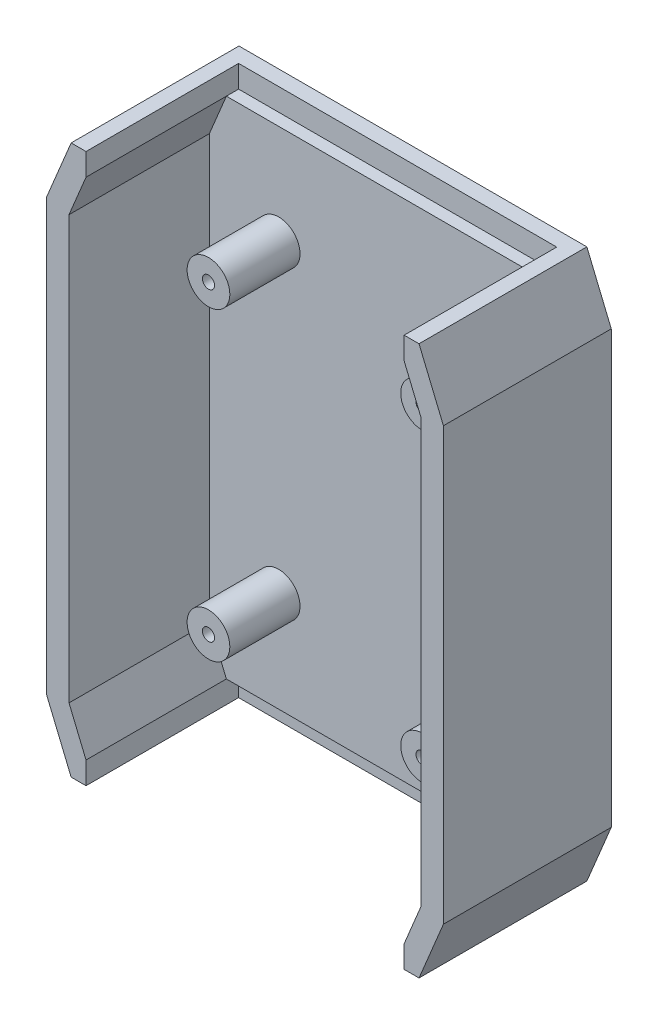
ISO-10303-21;
HEADER;
FILE_DESCRIPTION(('STEP AP214'),'2;1');
FILE_NAME('part.step','',(''),(''),'','','');
FILE_SCHEMA(('AUTOMOTIVE_DESIGN { 1 0 10303 214 1 1 1 1 }'));
ENDSEC;
DATA;
#1=APPLICATION_CONTEXT('core data for automotive mechanical design processes');
#2=APPLICATION_PROTOCOL_DEFINITION('international standard','automotive_design',2000,#1);
#3=PRODUCT_CONTEXT('',#1,'mechanical');
#4=PRODUCT('Part','Part','',(#3));
#5=PRODUCT_RELATED_PRODUCT_CATEGORY('part','',(#4));
#6=PRODUCT_DEFINITION_FORMATION('','',#4);
#7=PRODUCT_DEFINITION_CONTEXT('part definition',#1,'design');
#8=PRODUCT_DEFINITION('design','',#6,#7);
#9=PRODUCT_DEFINITION_SHAPE('','',#8);
#10=(LENGTH_UNIT() NAMED_UNIT(*) SI_UNIT(.MILLI.,.METRE.));
#11=(NAMED_UNIT(*) PLANE_ANGLE_UNIT() SI_UNIT($,.RADIAN.));
#12=(NAMED_UNIT(*) SI_UNIT($,.STERADIAN.) SOLID_ANGLE_UNIT());
#13=UNCERTAINTY_MEASURE_WITH_UNIT(LENGTH_MEASURE(1.E-05),#10,'distance_accuracy_value','');
#14=(GEOMETRIC_REPRESENTATION_CONTEXT(3) GLOBAL_UNCERTAINTY_ASSIGNED_CONTEXT((#13)) GLOBAL_UNIT_ASSIGNED_CONTEXT((#10,
#11,#12)) REPRESENTATION_CONTEXT('',''));
#15=CARTESIAN_POINT('',(0.,0.,0.));
#16=DIRECTION('',(0.,0.,1.));
#17=DIRECTION('',(1.,0.,0.));
#18=AXIS2_PLACEMENT_3D('',#15,#16,#17);
#19=CARTESIAN_POINT('',(0.,-57.15,5.715));
#20=DIRECTION('',(0.,1.,0.));
#21=DIRECTION('',(0.,0.,1.));
#22=AXIS2_PLACEMENT_3D('',#19,#20,#21);
#23=PLANE('',#22);
#24=DIRECTION('',(0.,0.,1.));
#25=VECTOR('',#24,1.);
#26=CARTESIAN_POINT('',(-33.1004294659972,-57.15,3.175));
#27=LINE('',#26,#25);
#28=CARTESIAN_POINT('',(-33.1004294659972,-57.15,3.175));
#29=VERTEX_POINT('',#28);
#30=CARTESIAN_POINT('',(-33.1004294659972,-57.15,34.925));
#31=VERTEX_POINT('',#30);
#32=EDGE_CURVE('E186',#29,#31,#27,.T.);
#33=ORIENTED_EDGE('',*,*,#32,.T.);
#34=DIRECTION('',(1.,0.,0.));
#35=VECTOR('',#34,1.);
#36=CARTESIAN_POINT('',(0.,-57.15,34.925));
#37=LINE('',#36,#35);
#38=CARTESIAN_POINT('',(-36.195,-57.15,34.925));
#39=VERTEX_POINT('',#38);
#40=EDGE_CURVE('E277',#39,#31,#37,.T.);
#41=ORIENTED_EDGE('',*,*,#40,.F.);
#42=DIRECTION('',(0.,0.,-1.));
#43=VECTOR('',#42,1.);
#44=CARTESIAN_POINT('',(-36.195,-57.15,5.715));
#45=LINE('',#44,#43);
#46=CARTESIAN_POINT('',(-36.195,-57.15,0.));
#47=VERTEX_POINT('',#46);
#48=EDGE_CURVE('E11',#39,#47,#45,.T.);
#49=ORIENTED_EDGE('',*,*,#48,.T.);
#50=DIRECTION('',(1.,0.,0.));
#51=VECTOR('',#50,1.);
#52=CARTESIAN_POINT('',(0.,-57.15,0.));
#53=LINE('',#52,#51);
#54=CARTESIAN_POINT('',(36.195,-57.15,0.));
#55=VERTEX_POINT('',#54);
#56=EDGE_CURVE('E336',#47,#55,#53,.T.);
#57=ORIENTED_EDGE('',*,*,#56,.T.);
#58=DIRECTION('',(0.,0.,-1.));
#59=VECTOR('',#58,1.);
#60=CARTESIAN_POINT('',(36.195,-57.15,5.715));
#61=LINE('',#60,#59);
#62=CARTESIAN_POINT('',(36.195,-57.1499999999999,34.925));
#63=VERTEX_POINT('',#62);
#64=EDGE_CURVE('E45',#63,#55,#61,.T.);
#65=ORIENTED_EDGE('',*,*,#64,.F.);
#66=CARTESIAN_POINT('',(33.1004294659972,-57.15,34.925));
#67=VERTEX_POINT('',#66);
#68=EDGE_CURVE('E276',#67,#63,#37,.T.);
#69=ORIENTED_EDGE('',*,*,#68,.F.);
#70=DIRECTION('',(0.,0.,1.));
#71=VECTOR('',#70,1.);
#72=CARTESIAN_POINT('',(33.1004294659972,-57.15,3.175));
#73=LINE('',#72,#71);
#74=CARTESIAN_POINT('',(33.1004294659972,-57.15,3.175));
#75=VERTEX_POINT('',#74);
#76=EDGE_CURVE('E198',#75,#67,#73,.T.);
#77=ORIENTED_EDGE('',*,*,#76,.F.);
#78=DIRECTION('',(-1.,0.,0.));
#79=VECTOR('',#78,1.);
#80=CARTESIAN_POINT('',(-33.1004294659972,-57.15,3.175));
#81=LINE('',#80,#79);
#82=EDGE_CURVE('E205',#75,#29,#81,.T.);
#83=ORIENTED_EDGE('',*,*,#82,.T.);
#84=EDGE_LOOP('',(#33,#41,#49,#57,#65,#69,#77,#83));
#85=FACE_BOUND('',#84,.T.);
#86=ADVANCED_FACE('F37',(#85),#23,.F.);
#87=CARTESIAN_POINT('',(0.,0.,34.925));
#88=DIRECTION('',(0.,0.,1.));
#89=DIRECTION('',(1.,0.,0.));
#90=AXIS2_PLACEMENT_3D('',#87,#88,#89);
#91=PLANE('',#90);
#92=ORIENTED_EDGE('',*,*,#40,.T.);
#93=DIRECTION('',(0.,1.,0.));
#94=VECTOR('',#93,1.);
#95=CARTESIAN_POINT('',(-33.1004294659972,-52.5145,34.925));
#96=LINE('',#95,#94);
#97=CARTESIAN_POINT('',(-33.1004294659972,-52.5145,34.925));
#98=VERTEX_POINT('',#97);
#99=EDGE_CURVE('E193',#31,#98,#96,.T.);
#100=ORIENTED_EDGE('',*,*,#99,.T.);
#101=DIRECTION('',(0.383447283100766,-0.923562765101886,0.));
#102=VECTOR('',#101,1.);
#103=CARTESIAN_POINT('',(-46.830973845541,-19.4434101986071,34.925));
#104=LINE('',#103,#102);
#105=CARTESIAN_POINT('',(-36.6395,-43.9903718803719,34.925));
#106=VERTEX_POINT('',#105);
#107=EDGE_CURVE('E264',#106,#98,#104,.T.);
#108=ORIENTED_EDGE('',*,*,#107,.F.);
#109=DIRECTION('',(0.,-1.,0.));
#110=VECTOR('',#109,1.);
#111=CARTESIAN_POINT('',(-36.6395,0.,34.925));
#112=LINE('',#111,#110);
#113=CARTESIAN_POINT('',(-36.6395,43.9903718803719,34.925));
#114=VERTEX_POINT('',#113);
#115=EDGE_CURVE('E267',#114,#106,#112,.T.);
#116=ORIENTED_EDGE('',*,*,#115,.F.);
#117=DIRECTION('',(-0.383447283100766,-0.923562765101886,0.));
#118=VECTOR('',#117,1.);
#119=CARTESIAN_POINT('',(-46.830973845541,19.443410198607,34.925));
#120=LINE('',#119,#118);
#121=CARTESIAN_POINT('',(-33.1004294659972,52.5145,34.925));
#122=VERTEX_POINT('',#121);
#123=EDGE_CURVE('E251',#122,#114,#120,.T.);
#124=ORIENTED_EDGE('',*,*,#123,.F.);
#125=DIRECTION('',(0.,-1.,0.));
#126=VECTOR('',#125,1.);
#127=CARTESIAN_POINT('',(-33.1004294659972,52.5145,34.925));
#128=LINE('',#127,#126);
#129=CARTESIAN_POINT('',(-33.1004294659972,57.15,34.925));
#130=VERTEX_POINT('',#129);
#131=EDGE_CURVE('E222',#130,#122,#128,.T.);
#132=ORIENTED_EDGE('',*,*,#131,.F.);
#133=DIRECTION('',(-1.,0.,0.));
#134=VECTOR('',#133,1.);
#135=CARTESIAN_POINT('',(0.,57.15,34.925));
#136=LINE('',#135,#134);
#137=CARTESIAN_POINT('',(-36.195,57.15,34.925));
#138=VERTEX_POINT('',#137);
#139=EDGE_CURVE('E288',#130,#138,#136,.T.);
#140=ORIENTED_EDGE('',*,*,#139,.T.);
#141=DIRECTION('',(-0.383447283100767,-0.923562765101886,0.));
#142=VECTOR('',#141,1.);
#143=CARTESIAN_POINT('',(-51.1121490431708,21.2208800794207,34.925));
#144=LINE('',#143,#142);
#145=CARTESIAN_POINT('',(-41.275,44.9144227681626,34.925));
#146=VERTEX_POINT('',#145);
#147=EDGE_CURVE('E292',#138,#146,#144,.T.);
#148=ORIENTED_EDGE('',*,*,#147,.T.);
#149=DIRECTION('',(0.,-1.,0.));
#150=VECTOR('',#149,1.);
#151=CARTESIAN_POINT('',(-41.275,0.,34.925));
#152=LINE('',#151,#150);
#153=CARTESIAN_POINT('',(-41.275,-44.9144227681627,34.925));
#154=VERTEX_POINT('',#153);
#155=EDGE_CURVE('E270',#146,#154,#152,.T.);
#156=ORIENTED_EDGE('',*,*,#155,.T.);
#157=DIRECTION('',(0.383447283100767,-0.923562765101886,0.));
#158=VECTOR('',#157,1.);
#159=CARTESIAN_POINT('',(-51.1121490431708,-21.2208800794207,34.925));
#160=LINE('',#159,#158);
#161=EDGE_CURVE('E273',#154,#39,#160,.T.);
#162=ORIENTED_EDGE('',*,*,#161,.T.);
#163=EDGE_LOOP('',(#92,#100,#108,#116,#124,#132,#140,#148,#156,#162));
#164=FACE_BOUND('',#163,.T.);
#165=ADVANCED_FACE('F401',(#164),#91,.T.);
#166=DIRECTION('',(0.383447283100766,0.923562765101886,0.));
#167=VECTOR('',#166,1.);
#168=CARTESIAN_POINT('',(46.830973845541,-19.443410198607,34.925));
#169=LINE('',#168,#167);
#170=CARTESIAN_POINT('',(33.1004294659972,-52.5145,34.925));
#171=VERTEX_POINT('',#170);
#172=CARTESIAN_POINT('',(36.6395,-43.9903718803721,34.925));
#173=VERTEX_POINT('',#172);
#174=EDGE_CURVE('E261',#171,#173,#169,.T.);
#175=ORIENTED_EDGE('',*,*,#174,.F.);
#176=DIRECTION('',(0.,-1.,0.));
#177=VECTOR('',#176,1.);
#178=CARTESIAN_POINT('',(33.1004294659972,-52.5145,34.925));
#179=LINE('',#178,#177);
#180=EDGE_CURVE('E207',#171,#67,#179,.T.);
#181=ORIENTED_EDGE('',*,*,#180,.T.);
#182=ORIENTED_EDGE('',*,*,#68,.T.);
#183=DIRECTION('',(0.383447283100766,0.923562765101886,0.));
#184=VECTOR('',#183,1.);
#185=CARTESIAN_POINT('',(51.1121490431708,-21.2208800794207,34.925));
#186=LINE('',#185,#184);
#187=CARTESIAN_POINT('',(41.275,-44.9144227681628,34.925));
#188=VERTEX_POINT('',#187);
#189=EDGE_CURVE('E279',#63,#188,#186,.T.);
#190=ORIENTED_EDGE('',*,*,#189,.T.);
#191=DIRECTION('',(0.,1.,0.));
#192=VECTOR('',#191,1.);
#193=CARTESIAN_POINT('',(41.275,0.,34.925));
#194=LINE('',#193,#192);
#195=CARTESIAN_POINT('',(41.275,44.9144227681628,34.925));
#196=VERTEX_POINT('',#195);
#197=EDGE_CURVE('E282',#188,#196,#194,.T.);
#198=ORIENTED_EDGE('',*,*,#197,.T.);
#199=DIRECTION('',(-0.383447283100766,0.923562765101886,0.));
#200=VECTOR('',#199,1.);
#201=CARTESIAN_POINT('',(51.1121490431708,21.2208800794207,34.925));
#202=LINE('',#201,#200);
#203=CARTESIAN_POINT('',(36.195,57.15,34.925));
#204=VERTEX_POINT('',#203);
#205=EDGE_CURVE('E285',#196,#204,#202,.T.);
#206=ORIENTED_EDGE('',*,*,#205,.T.);
#207=CARTESIAN_POINT('',(33.1004294659972,57.15,34.925));
#208=VERTEX_POINT('',#207);
#209=EDGE_CURVE('E289',#204,#208,#136,.T.);
#210=ORIENTED_EDGE('',*,*,#209,.T.);
#211=DIRECTION('',(0.,1.,0.));
#212=VECTOR('',#211,1.);
#213=CARTESIAN_POINT('',(33.1004294659972,52.5145,34.925));
#214=LINE('',#213,#212);
#215=CARTESIAN_POINT('',(33.1004294659972,52.5145,34.925));
#216=VERTEX_POINT('',#215);
#217=EDGE_CURVE('E230',#216,#208,#214,.T.);
#218=ORIENTED_EDGE('',*,*,#217,.F.);
#219=DIRECTION('',(-0.383447283100766,0.923562765101886,0.));
#220=VECTOR('',#219,1.);
#221=CARTESIAN_POINT('',(46.830973845541,19.443410198607,34.925));
#222=LINE('',#221,#220);
#223=CARTESIAN_POINT('',(36.6394999999999,43.9903718803721,34.925));
#224=VERTEX_POINT('',#223);
#225=EDGE_CURVE('E254',#224,#216,#222,.T.);
#226=ORIENTED_EDGE('',*,*,#225,.F.);
#227=DIRECTION('',(0.,1.,0.));
#228=VECTOR('',#227,1.);
#229=CARTESIAN_POINT('',(36.6395,0.,34.925));
#230=LINE('',#229,#228);
#231=EDGE_CURVE('E258',#173,#224,#230,.T.);
#232=ORIENTED_EDGE('',*,*,#231,.F.);
#233=EDGE_LOOP('',(#175,#181,#182,#190,#198,#206,#210,#218,#226,#232));
#234=FACE_BOUND('',#233,.T.);
#235=ADVANCED_FACE('F384',(#234),#91,.T.);
#236=CARTESIAN_POINT('',(-51.1121490431708,-21.2208800794207,5.715));
#237=DIRECTION('',(-0.923562765101886,-0.383447283100766,0.));
#238=DIRECTION('',(0.383447283100767,-0.923562765101886,0.));
#239=AXIS2_PLACEMENT_3D('',#236,#237,#238);
#240=PLANE('',#239);
#241=DIRECTION('',(-0.383447283100767,0.923562765101886,0.));
#242=VECTOR('',#241,1.);
#243=CARTESIAN_POINT('',(-51.1121490431708,-21.2208800794207,0.));
#244=LINE('',#243,#242);
#245=CARTESIAN_POINT('',(-41.275,-44.9144227681627,0.));
#246=VERTEX_POINT('',#245);
#247=EDGE_CURVE('E333',#47,#246,#244,.T.);
#248=ORIENTED_EDGE('',*,*,#247,.F.);
#249=ORIENTED_EDGE('',*,*,#48,.F.);
#250=ORIENTED_EDGE('',*,*,#161,.F.);
#251=DIRECTION('',(0.,0.,-1.));
#252=VECTOR('',#251,1.);
#253=CARTESIAN_POINT('',(-41.275,-44.9144227681627,5.715));
#254=LINE('',#253,#252);
#255=EDGE_CURVE('E355',#154,#246,#254,.T.);
#256=ORIENTED_EDGE('',*,*,#255,.T.);
#257=EDGE_LOOP('',(#248,#249,#250,#256));
#258=FACE_BOUND('',#257,.T.);
#259=ADVANCED_FACE('F39',(#258),#240,.T.);
#260=CARTESIAN_POINT('',(51.1121490431708,-21.2208800794207,5.715));
#261=DIRECTION('',(-0.923562765101886,0.383447283100766,0.));
#262=DIRECTION('',(-0.383447283100766,-0.923562765101886,0.));
#263=AXIS2_PLACEMENT_3D('',#260,#261,#262);
#264=PLANE('',#263);
#265=DIRECTION('',(0.383447283100766,0.923562765101886,0.));
#266=VECTOR('',#265,1.);
#267=CARTESIAN_POINT('',(51.1121490431708,-21.2208800794207,0.));
#268=LINE('',#267,#266);
#269=CARTESIAN_POINT('',(41.275,-44.9144227681628,0.));
#270=VERTEX_POINT('',#269);
#271=EDGE_CURVE('E338',#55,#270,#268,.T.);
#272=ORIENTED_EDGE('',*,*,#271,.T.);
#273=DIRECTION('',(0.,0.,-1.));
#274=VECTOR('',#273,1.);
#275=CARTESIAN_POINT('',(41.275,-44.9144227681628,5.715));
#276=LINE('',#275,#274);
#277=EDGE_CURVE('E366',#188,#270,#276,.T.);
#278=ORIENTED_EDGE('',*,*,#277,.F.);
#279=ORIENTED_EDGE('',*,*,#189,.F.);
#280=ORIENTED_EDGE('',*,*,#64,.T.);
#281=EDGE_LOOP('',(#272,#278,#279,#280));
#282=FACE_BOUND('',#281,.T.);
#283=ADVANCED_FACE('F372',(#282),#264,.F.);
#284=CARTESIAN_POINT('',(41.275,0.,5.715));
#285=DIRECTION('',(1.,0.,0.));
#286=DIRECTION('',(0.,1.,0.));
#287=AXIS2_PLACEMENT_3D('',#284,#285,#286);
#288=PLANE('',#287);
#289=DIRECTION('',(0.,-1.,0.));
#290=VECTOR('',#289,1.);
#291=CARTESIAN_POINT('',(41.275,0.,0.));
#292=LINE('',#291,#290);
#293=CARTESIAN_POINT('',(41.275,44.9144227681628,0.));
#294=VERTEX_POINT('',#293);
#295=EDGE_CURVE('E341',#294,#270,#292,.T.);
#296=ORIENTED_EDGE('',*,*,#295,.F.);
#297=DIRECTION('',(0.,0.,-1.));
#298=VECTOR('',#297,1.);
#299=CARTESIAN_POINT('',(41.275,44.9144227681628,5.715));
#300=LINE('',#299,#298);
#301=EDGE_CURVE('E364',#196,#294,#300,.T.);
#302=ORIENTED_EDGE('',*,*,#301,.F.);
#303=ORIENTED_EDGE('',*,*,#197,.F.);
#304=ORIENTED_EDGE('',*,*,#277,.T.);
#305=EDGE_LOOP('',(#296,#302,#303,#304));
#306=FACE_BOUND('',#305,.T.);
#307=ADVANCED_FACE('F380',(#306),#288,.T.);
#308=CARTESIAN_POINT('',(51.1121490431708,21.2208800794207,5.715));
#309=DIRECTION('',(0.923562765101886,0.383447283100766,0.));
#310=DIRECTION('',(-0.383447283100766,0.923562765101886,0.));
#311=AXIS2_PLACEMENT_3D('',#308,#309,#310);
#312=PLANE('',#311);
#313=DIRECTION('',(0.383447283100766,-0.923562765101886,0.));
#314=VECTOR('',#313,1.);
#315=CARTESIAN_POINT('',(51.1121490431708,21.2208800794207,0.));
#316=LINE('',#315,#314);
#317=CARTESIAN_POINT('',(36.195,57.15,0.));
#318=VERTEX_POINT('',#317);
#319=EDGE_CURVE('E344',#318,#294,#316,.T.);
#320=ORIENTED_EDGE('',*,*,#319,.F.);
#321=DIRECTION('',(0.,0.,-1.));
#322=VECTOR('',#321,1.);
#323=CARTESIAN_POINT('',(36.195,57.15,5.715));
#324=LINE('',#323,#322);
#325=EDGE_CURVE('E362',#204,#318,#324,.T.);
#326=ORIENTED_EDGE('',*,*,#325,.F.);
#327=ORIENTED_EDGE('',*,*,#205,.F.);
#328=ORIENTED_EDGE('',*,*,#301,.T.);
#329=EDGE_LOOP('',(#320,#326,#327,#328));
#330=FACE_BOUND('',#329,.T.);
#331=ADVANCED_FACE('F441',(#330),#312,.T.);
#332=CARTESIAN_POINT('',(0.,57.15,5.715));
#333=DIRECTION('',(0.,1.,0.));
#334=DIRECTION('',(0.,0.,1.));
#335=AXIS2_PLACEMENT_3D('',#332,#333,#334);
#336=PLANE('',#335);
#337=DIRECTION('',(0.,0.,1.));
#338=VECTOR('',#337,1.);
#339=CARTESIAN_POINT('',(-33.1004294659972,57.15,3.175));
#340=LINE('',#339,#338);
#341=CARTESIAN_POINT('',(-33.1004294659972,57.15,3.175));
#342=VERTEX_POINT('',#341);
#343=EDGE_CURVE('E241',#342,#130,#340,.T.);
#344=ORIENTED_EDGE('',*,*,#343,.F.);
#345=DIRECTION('',(-1.,0.,0.));
#346=VECTOR('',#345,1.);
#347=CARTESIAN_POINT('',(-33.1004294659972,57.15,3.175));
#348=LINE('',#347,#346);
#349=CARTESIAN_POINT('',(33.1004294659972,57.15,3.175));
#350=VERTEX_POINT('',#349);
#351=EDGE_CURVE('E236',#350,#342,#348,.T.);
#352=ORIENTED_EDGE('',*,*,#351,.F.);
#353=DIRECTION('',(0.,0.,1.));
#354=VECTOR('',#353,1.);
#355=CARTESIAN_POINT('',(33.1004294659972,57.15,3.175));
#356=LINE('',#355,#354);
#357=EDGE_CURVE('E244',#350,#208,#356,.T.);
#358=ORIENTED_EDGE('',*,*,#357,.T.);
#359=ORIENTED_EDGE('',*,*,#209,.F.);
#360=ORIENTED_EDGE('',*,*,#325,.T.);
#361=DIRECTION('',(1.,0.,0.));
#362=VECTOR('',#361,1.);
#363=CARTESIAN_POINT('',(0.,57.15,0.));
#364=LINE('',#363,#362);
#365=CARTESIAN_POINT('',(-36.195,57.15,0.));
#366=VERTEX_POINT('',#365);
#367=EDGE_CURVE('E347',#366,#318,#364,.T.);
#368=ORIENTED_EDGE('',*,*,#367,.F.);
#369=DIRECTION('',(0.,0.,-1.));
#370=VECTOR('',#369,1.);
#371=CARTESIAN_POINT('',(-36.195,57.15,5.715));
#372=LINE('',#371,#370);
#373=EDGE_CURVE('E360',#138,#366,#372,.T.);
#374=ORIENTED_EDGE('',*,*,#373,.F.);
#375=ORIENTED_EDGE('',*,*,#139,.F.);
#376=EDGE_LOOP('',(#344,#352,#358,#359,#360,#368,#374,#375));
#377=FACE_BOUND('',#376,.T.);
#378=ADVANCED_FACE('F427',(#377),#336,.T.);
#379=CARTESIAN_POINT('',(-51.1121490431708,21.2208800794207,5.715));
#380=DIRECTION('',(0.923562765101886,-0.383447283100766,0.));
#381=DIRECTION('',(0.383447283100767,0.923562765101886,0.));
#382=AXIS2_PLACEMENT_3D('',#379,#380,#381);
#383=PLANE('',#382);
#384=DIRECTION('',(-0.383447283100767,-0.923562765101886,0.));
#385=VECTOR('',#384,1.);
#386=CARTESIAN_POINT('',(-51.1121490431708,21.2208800794207,0.));
#387=LINE('',#386,#385);
#388=CARTESIAN_POINT('',(-41.275,44.9144227681626,0.));
#389=VERTEX_POINT('',#388);
#390=EDGE_CURVE('E350',#366,#389,#387,.T.);
#391=ORIENTED_EDGE('',*,*,#390,.T.);
#392=DIRECTION('',(0.,0.,-1.));
#393=VECTOR('',#392,1.);
#394=CARTESIAN_POINT('',(-41.275,44.9144227681626,5.715));
#395=LINE('',#394,#393);
#396=EDGE_CURVE('E357',#146,#389,#395,.T.);
#397=ORIENTED_EDGE('',*,*,#396,.F.);
#398=ORIENTED_EDGE('',*,*,#147,.F.);
#399=ORIENTED_EDGE('',*,*,#373,.T.);
#400=EDGE_LOOP('',(#391,#397,#398,#399));
#401=FACE_BOUND('',#400,.T.);
#402=ADVANCED_FACE('F469',(#401),#383,.F.);
#403=CARTESIAN_POINT('',(-41.275,0.,5.715));
#404=DIRECTION('',(1.,0.,0.));
#405=DIRECTION('',(0.,1.,0.));
#406=AXIS2_PLACEMENT_3D('',#403,#404,#405);
#407=PLANE('',#406);
#408=DIRECTION('',(0.,-1.,0.));
#409=VECTOR('',#408,1.);
#410=CARTESIAN_POINT('',(-41.275,0.,0.));
#411=LINE('',#410,#409);
#412=EDGE_CURVE('E352',#389,#246,#411,.T.);
#413=ORIENTED_EDGE('',*,*,#412,.T.);
#414=ORIENTED_EDGE('',*,*,#255,.F.);
#415=ORIENTED_EDGE('',*,*,#155,.F.);
#416=ORIENTED_EDGE('',*,*,#396,.T.);
#417=EDGE_LOOP('',(#413,#414,#415,#416));
#418=FACE_BOUND('',#417,.T.);
#419=ADVANCED_FACE('F434',(#418),#407,.F.);
#420=CARTESIAN_POINT('',(0.,0.,0.));
#421=DIRECTION('',(0.,0.,1.));
#422=DIRECTION('',(1.,0.,0.));
#423=AXIS2_PLACEMENT_3D('',#420,#421,#422);
#424=PLANE('',#423);
#425=ORIENTED_EDGE('',*,*,#247,.T.);
#426=ORIENTED_EDGE('',*,*,#412,.F.);
#427=ORIENTED_EDGE('',*,*,#390,.F.);
#428=ORIENTED_EDGE('',*,*,#367,.T.);
#429=ORIENTED_EDGE('',*,*,#319,.T.);
#430=ORIENTED_EDGE('',*,*,#295,.T.);
#431=ORIENTED_EDGE('',*,*,#271,.F.);
#432=ORIENTED_EDGE('',*,*,#56,.F.);
#433=EDGE_LOOP('',(#425,#426,#427,#428,#429,#430,#431,#432));
#434=FACE_BOUND('',#433,.T.);
#435=ADVANCED_FACE('F375',(#434),#424,.F.);
#436=CARTESIAN_POINT('',(-46.830973845541,19.443410198607,34.925));
#437=DIRECTION('',(0.923562765101886,-0.383447283100766,0.));
#438=DIRECTION('',(0.383447283100766,0.923562765101886,0.));
#439=AXIS2_PLACEMENT_3D('',#436,#437,#438);
#440=PLANE('',#439);
#441=DIRECTION('',(-0.383447283100766,-0.923562765101886,0.));
#442=VECTOR('',#441,1.);
#443=CARTESIAN_POINT('',(-46.830973845541,19.443410198607,5.715));
#444=LINE('',#443,#442);
#445=CARTESIAN_POINT('',(-33.1004294659972,52.5145,5.715));
#446=VERTEX_POINT('',#445);
#447=CARTESIAN_POINT('',(-36.6395,43.9903718803719,5.715));
#448=VERTEX_POINT('',#447);
#449=EDGE_CURVE('E243',#446,#448,#444,.T.);
#450=ORIENTED_EDGE('',*,*,#449,.F.);
#451=DIRECTION('',(0.,0.,-1.));
#452=VECTOR('',#451,1.);
#453=CARTESIAN_POINT('',(-33.1004294659972,52.5145,34.925));
#454=LINE('',#453,#452);
#455=EDGE_CURVE('E331',#122,#446,#454,.T.);
#456=ORIENTED_EDGE('',*,*,#455,.F.);
#457=ORIENTED_EDGE('',*,*,#123,.T.);
#458=DIRECTION('',(0.,0.,-1.));
#459=VECTOR('',#458,1.);
#460=CARTESIAN_POINT('',(-36.6395,43.9903718803719,34.925));
#461=LINE('',#460,#459);
#462=EDGE_CURVE('E295',#114,#448,#461,.T.);
#463=ORIENTED_EDGE('',*,*,#462,.T.);
#464=EDGE_LOOP('',(#450,#456,#457,#463));
#465=FACE_BOUND('',#464,.T.);
#466=ADVANCED_FACE('F413',(#465),#440,.T.);
#467=CARTESIAN_POINT('',(46.830973845541,19.443410198607,34.925));
#468=DIRECTION('',(-0.923562765101886,-0.383447283100766,0.));
#469=DIRECTION('',(0.383447283100766,-0.923562765101886,0.));
#470=AXIS2_PLACEMENT_3D('',#467,#468,#469);
#471=PLANE('',#470);
#472=DIRECTION('',(-0.383447283100766,0.923562765101886,0.));
#473=VECTOR('',#472,1.);
#474=CARTESIAN_POINT('',(46.830973845541,19.443410198607,5.715));
#475=LINE('',#474,#473);
#476=CARTESIAN_POINT('',(36.6395,43.9903718803721,5.715));
#477=VERTEX_POINT('',#476);
#478=CARTESIAN_POINT('',(33.1004294659972,52.5145,5.715));
#479=VERTEX_POINT('',#478);
#480=EDGE_CURVE('E300',#477,#479,#475,.T.);
#481=ORIENTED_EDGE('',*,*,#480,.F.);
#482=DIRECTION('',(0.,0.,-1.));
#483=VECTOR('',#482,1.);
#484=CARTESIAN_POINT('',(36.6394999999999,43.9903718803721,34.925));
#485=LINE('',#484,#483);
#486=EDGE_CURVE('E326',#224,#477,#485,.T.);
#487=ORIENTED_EDGE('',*,*,#486,.F.);
#488=ORIENTED_EDGE('',*,*,#225,.T.);
#489=DIRECTION('',(0.,0.,-1.));
#490=VECTOR('',#489,1.);
#491=CARTESIAN_POINT('',(33.1004294659972,52.5145,34.925));
#492=LINE('',#491,#490);
#493=EDGE_CURVE('E328',#216,#479,#492,.T.);
#494=ORIENTED_EDGE('',*,*,#493,.T.);
#495=EDGE_LOOP('',(#481,#487,#488,#494));
#496=FACE_BOUND('',#495,.T.);
#497=ADVANCED_FACE('F444',(#496),#471,.T.);
#498=CARTESIAN_POINT('',(36.6395,0.,34.925));
#499=DIRECTION('',(-1.,0.,0.));
#500=DIRECTION('',(0.,-1.,0.));
#501=AXIS2_PLACEMENT_3D('',#498,#499,#500);
#502=PLANE('',#501);
#503=DIRECTION('',(0.,1.,0.));
#504=VECTOR('',#503,1.);
#505=CARTESIAN_POINT('',(36.6395,0.,5.715));
#506=LINE('',#505,#504);
#507=CARTESIAN_POINT('',(36.6395,-43.9903718803721,5.715));
#508=VERTEX_POINT('',#507);
#509=EDGE_CURVE('E60',#508,#477,#506,.T.);
#510=ORIENTED_EDGE('',*,*,#509,.F.);
#511=DIRECTION('',(0.,0.,-1.));
#512=VECTOR('',#511,1.);
#513=CARTESIAN_POINT('',(36.6395,-43.9903718803721,34.925));
#514=LINE('',#513,#512);
#515=EDGE_CURVE('E323',#173,#508,#514,.T.);
#516=ORIENTED_EDGE('',*,*,#515,.F.);
#517=ORIENTED_EDGE('',*,*,#231,.T.);
#518=ORIENTED_EDGE('',*,*,#486,.T.);
#519=EDGE_LOOP('',(#510,#516,#517,#518));
#520=FACE_BOUND('',#519,.T.);
#521=ADVANCED_FACE('F446',(#520),#502,.T.);
#522=CARTESIAN_POINT('',(46.830973845541,-19.443410198607,34.925));
#523=DIRECTION('',(-0.923562765101886,0.383447283100766,0.));
#524=DIRECTION('',(-0.383447283100766,-0.923562765101886,0.));
#525=AXIS2_PLACEMENT_3D('',#522,#523,#524);
#526=PLANE('',#525);
#527=DIRECTION('',(0.383447283100766,0.923562765101886,0.));
#528=VECTOR('',#527,1.);
#529=CARTESIAN_POINT('',(46.830973845541,-19.443410198607,5.715));
#530=LINE('',#529,#528);
#531=CARTESIAN_POINT('',(33.1004294659972,-52.5145,5.715));
#532=VERTEX_POINT('',#531);
#533=EDGE_CURVE('E303',#532,#508,#530,.T.);
#534=ORIENTED_EDGE('',*,*,#533,.F.);
#535=DIRECTION('',(0.,0.,-1.));
#536=VECTOR('',#535,1.);
#537=CARTESIAN_POINT('',(33.1004294659972,-52.5145,34.925));
#538=LINE('',#537,#536);
#539=EDGE_CURVE('E320',#171,#532,#538,.T.);
#540=ORIENTED_EDGE('',*,*,#539,.F.);
#541=ORIENTED_EDGE('',*,*,#174,.T.);
#542=ORIENTED_EDGE('',*,*,#515,.T.);
#543=EDGE_LOOP('',(#534,#540,#541,#542));
#544=FACE_BOUND('',#543,.T.);
#545=ADVANCED_FACE('F393',(#544),#526,.T.);
#546=CARTESIAN_POINT('',(-46.830973845541,-19.4434101986071,34.925));
#547=DIRECTION('',(0.923562765101886,0.383447283100766,0.));
#548=DIRECTION('',(-0.383447283100766,0.923562765101886,0.));
#549=AXIS2_PLACEMENT_3D('',#546,#547,#548);
#550=PLANE('',#549);
#551=DIRECTION('',(0.383447283100766,-0.923562765101886,0.));
#552=VECTOR('',#551,1.);
#553=CARTESIAN_POINT('',(-46.830973845541,-19.4434101986071,5.715));
#554=LINE('',#553,#552);
#555=CARTESIAN_POINT('',(-36.6395,-43.9903718803719,5.715));
#556=VERTEX_POINT('',#555);
#557=CARTESIAN_POINT('',(-33.1004294659972,-52.5145,5.715));
#558=VERTEX_POINT('',#557);
#559=EDGE_CURVE('E308',#556,#558,#554,.T.);
#560=ORIENTED_EDGE('',*,*,#559,.F.);
#561=DIRECTION('',(0.,0.,-1.));
#562=VECTOR('',#561,1.);
#563=CARTESIAN_POINT('',(-36.6395,-43.9903718803719,34.925));
#564=LINE('',#563,#562);
#565=EDGE_CURVE('E314',#106,#556,#564,.T.);
#566=ORIENTED_EDGE('',*,*,#565,.F.);
#567=ORIENTED_EDGE('',*,*,#107,.T.);
#568=DIRECTION('',(0.,0.,-1.));
#569=VECTOR('',#568,1.);
#570=CARTESIAN_POINT('',(-33.1004294659972,-52.5145,34.925));
#571=LINE('',#570,#569);
#572=EDGE_CURVE('E317',#98,#558,#571,.T.);
#573=ORIENTED_EDGE('',*,*,#572,.T.);
#574=EDGE_LOOP('',(#560,#566,#567,#573));
#575=FACE_BOUND('',#574,.T.);
#576=ADVANCED_FACE('F403',(#575),#550,.T.);
#577=CARTESIAN_POINT('',(-36.6395,0.,34.925));
#578=DIRECTION('',(1.,0.,0.));
#579=DIRECTION('',(0.,1.,0.));
#580=AXIS2_PLACEMENT_3D('',#577,#578,#579);
#581=PLANE('',#580);
#582=DIRECTION('',(0.,-1.,0.));
#583=VECTOR('',#582,1.);
#584=CARTESIAN_POINT('',(-36.6395,0.,5.715));
#585=LINE('',#584,#583);
#586=EDGE_CURVE('E255',#448,#556,#585,.T.);
#587=ORIENTED_EDGE('',*,*,#586,.F.);
#588=ORIENTED_EDGE('',*,*,#462,.F.);
#589=ORIENTED_EDGE('',*,*,#115,.T.);
#590=ORIENTED_EDGE('',*,*,#565,.T.);
#591=EDGE_LOOP('',(#587,#588,#589,#590));
#592=FACE_BOUND('',#591,.T.);
#593=ADVANCED_FACE('F406',(#592),#581,.T.);
#594=CARTESIAN_POINT('',(0.,0.,5.715));
#595=DIRECTION('',(0.,0.,1.));
#596=DIRECTION('',(1.,0.,0.));
#597=AXIS2_PLACEMENT_3D('',#594,#595,#596);
#598=PLANE('',#597);
#599=CARTESIAN_POINT('',(-22.225,31.75,5.715));
#600=DIRECTION('',(0.,0.,1.));
#601=DIRECTION('',(1.,0.,0.));
#602=AXIS2_PLACEMENT_3D('',#599,#600,#601);
#603=CIRCLE('',#602,4.445);
#604=CARTESIAN_POINT('',(-17.78,31.75,5.715));
#605=VERTEX_POINT('',#604);
#606=EDGE_CURVE('E880',#605,#605,#603,.T.);
#607=ORIENTED_EDGE('',*,*,#606,.F.);
#608=EDGE_LOOP('',(#607));
#609=FACE_BOUND('',#608,.T.);
#610=CARTESIAN_POINT('',(22.225,31.75,5.715));
#611=DIRECTION('',(0.,0.,1.));
#612=DIRECTION('',(1.,0.,0.));
#613=AXIS2_PLACEMENT_3D('',#610,#611,#612);
#614=CIRCLE('',#613,4.445);
#615=CARTESIAN_POINT('',(26.67,31.75,5.715));
#616=VERTEX_POINT('',#615);
#617=EDGE_CURVE('E887',#616,#616,#614,.T.);
#618=ORIENTED_EDGE('',*,*,#617,.F.);
#619=EDGE_LOOP('',(#618));
#620=FACE_BOUND('',#619,.T.);
#621=CARTESIAN_POINT('',(-22.225,-31.75,5.715));
#622=DIRECTION('',(0.,0.,1.));
#623=DIRECTION('',(1.,0.,0.));
#624=AXIS2_PLACEMENT_3D('',#621,#622,#623);
#625=CIRCLE('',#624,4.445);
#626=CARTESIAN_POINT('',(-17.78,-31.75,5.715));
#627=VERTEX_POINT('',#626);
#628=EDGE_CURVE('E893',#627,#627,#625,.T.);
#629=ORIENTED_EDGE('',*,*,#628,.F.);
#630=EDGE_LOOP('',(#629));
#631=FACE_BOUND('',#630,.T.);
#632=CARTESIAN_POINT('',(22.225,-31.75,5.715));
#633=DIRECTION('',(0.,0.,1.));
#634=DIRECTION('',(1.,0.,0.));
#635=AXIS2_PLACEMENT_3D('',#632,#633,#634);
#636=CIRCLE('',#635,4.44499999999999);
#637=CARTESIAN_POINT('',(26.67,-31.75,5.715));
#638=VERTEX_POINT('',#637);
#639=EDGE_CURVE('E899',#638,#638,#636,.T.);
#640=ORIENTED_EDGE('',*,*,#639,.F.);
#641=EDGE_LOOP('',(#640));
#642=FACE_BOUND('',#641,.T.);
#643=ORIENTED_EDGE('',*,*,#449,.T.);
#644=ORIENTED_EDGE('',*,*,#586,.T.);
#645=ORIENTED_EDGE('',*,*,#559,.T.);
#646=DIRECTION('',(1.,0.,0.));
#647=VECTOR('',#646,1.);
#648=CARTESIAN_POINT('',(0.,-52.5145,5.715));
#649=LINE('',#648,#647);
#650=EDGE_CURVE('E305',#558,#532,#649,.T.);
#651=ORIENTED_EDGE('',*,*,#650,.T.);
#652=ORIENTED_EDGE('',*,*,#533,.T.);
#653=ORIENTED_EDGE('',*,*,#509,.T.);
#654=ORIENTED_EDGE('',*,*,#480,.T.);
#655=DIRECTION('',(-1.,0.,0.));
#656=VECTOR('',#655,1.);
#657=CARTESIAN_POINT('',(0.,52.5145,5.715));
#658=LINE('',#657,#656);
#659=EDGE_CURVE('E297',#479,#446,#658,.T.);
#660=ORIENTED_EDGE('',*,*,#659,.T.);
#661=EDGE_LOOP('',(#643,#644,#645,#651,#652,#653,#654,#660));
#662=FACE_BOUND('',#661,.T.);
#663=ADVANCED_FACE('F394',(#609,#620,#631,#642,#662),#598,.T.);
#664=CARTESIAN_POINT('',(-33.1004294659972,52.5145,3.175));
#665=DIRECTION('',(-1.,0.,0.));
#666=DIRECTION('',(0.,0.,1.));
#667=AXIS2_PLACEMENT_3D('',#664,#665,#666);
#668=PLANE('',#667);
#669=ORIENTED_EDGE('',*,*,#131,.T.);
#670=ORIENTED_EDGE('',*,*,#455,.T.);
#671=DIRECTION('',(0.,0.,1.));
#672=VECTOR('',#671,1.);
#673=CARTESIAN_POINT('',(-33.1004294659972,52.5145,3.175));
#674=LINE('',#673,#672);
#675=CARTESIAN_POINT('',(-33.1004294659972,52.5145,3.175));
#676=VERTEX_POINT('',#675);
#677=EDGE_CURVE('E52',#676,#446,#674,.T.);
#678=ORIENTED_EDGE('',*,*,#677,.F.);
#679=DIRECTION('',(0.,-1.,0.));
#680=VECTOR('',#679,1.);
#681=CARTESIAN_POINT('',(-33.1004294659972,52.5145,3.175));
#682=LINE('',#681,#680);
#683=EDGE_CURVE('E226',#342,#676,#682,.T.);
#684=ORIENTED_EDGE('',*,*,#683,.F.);
#685=ORIENTED_EDGE('',*,*,#343,.T.);
#686=EDGE_LOOP('',(#669,#670,#678,#684,#685));
#687=FACE_BOUND('',#686,.T.);
#688=ADVANCED_FACE('F415',(#687),#668,.F.);
#689=CARTESIAN_POINT('',(33.1004294659972,52.5145,3.175));
#690=DIRECTION('',(1.,0.,0.));
#691=DIRECTION('',(0.,0.,-1.));
#692=AXIS2_PLACEMENT_3D('',#689,#690,#691);
#693=PLANE('',#692);
#694=ORIENTED_EDGE('',*,*,#217,.T.);
#695=ORIENTED_EDGE('',*,*,#357,.F.);
#696=DIRECTION('',(0.,1.,0.));
#697=VECTOR('',#696,1.);
#698=CARTESIAN_POINT('',(33.1004294659972,52.5145,3.175));
#699=LINE('',#698,#697);
#700=CARTESIAN_POINT('',(33.1004294659972,52.5145,3.175));
#701=VERTEX_POINT('',#700);
#702=EDGE_CURVE('E233',#701,#350,#699,.T.);
#703=ORIENTED_EDGE('',*,*,#702,.F.);
#704=DIRECTION('',(0.,0.,1.));
#705=VECTOR('',#704,1.);
#706=CARTESIAN_POINT('',(33.1004294659972,52.5145,3.175));
#707=LINE('',#706,#705);
#708=EDGE_CURVE('E247',#701,#479,#707,.T.);
#709=ORIENTED_EDGE('',*,*,#708,.T.);
#710=ORIENTED_EDGE('',*,*,#493,.F.);
#711=EDGE_LOOP('',(#694,#695,#703,#709,#710));
#712=FACE_BOUND('',#711,.T.);
#713=ADVANCED_FACE('F420',(#712),#693,.F.);
#714=CARTESIAN_POINT('',(-33.1004294659972,52.5145,3.175));
#715=DIRECTION('',(0.,-1.,0.));
#716=DIRECTION('',(0.,0.,-1.));
#717=AXIS2_PLACEMENT_3D('',#714,#715,#716);
#718=PLANE('',#717);
#719=ORIENTED_EDGE('',*,*,#659,.F.);
#720=ORIENTED_EDGE('',*,*,#708,.F.);
#721=DIRECTION('',(1.,0.,0.));
#722=VECTOR('',#721,1.);
#723=CARTESIAN_POINT('',(-33.1004294659972,52.5145,3.175));
#724=LINE('',#723,#722);
#725=EDGE_CURVE('E229',#676,#701,#724,.T.);
#726=ORIENTED_EDGE('',*,*,#725,.F.);
#727=ORIENTED_EDGE('',*,*,#677,.T.);
#728=EDGE_LOOP('',(#719,#720,#726,#727));
#729=FACE_BOUND('',#728,.T.);
#730=ADVANCED_FACE('F417',(#729),#718,.F.);
#731=CARTESIAN_POINT('',(0.,0.,3.175));
#732=DIRECTION('',(0.,0.,-1.));
#733=DIRECTION('',(-1.,0.,0.));
#734=AXIS2_PLACEMENT_3D('',#731,#732,#733);
#735=PLANE('',#734);
#736=ORIENTED_EDGE('',*,*,#683,.T.);
#737=ORIENTED_EDGE('',*,*,#725,.T.);
#738=ORIENTED_EDGE('',*,*,#702,.T.);
#739=ORIENTED_EDGE('',*,*,#351,.T.);
#740=EDGE_LOOP('',(#736,#737,#738,#739));
#741=FACE_BOUND('',#740,.T.);
#742=ADVANCED_FACE('F424',(#741),#735,.F.);
#743=CARTESIAN_POINT('',(-33.1004294659972,-52.5145,3.175));
#744=DIRECTION('',(1.,0.,0.));
#745=DIRECTION('',(0.,0.,-1.));
#746=AXIS2_PLACEMENT_3D('',#743,#744,#745);
#747=PLANE('',#746);
#748=ORIENTED_EDGE('',*,*,#99,.F.);
#749=ORIENTED_EDGE('',*,*,#32,.F.);
#750=DIRECTION('',(0.,1.,0.));
#751=VECTOR('',#750,1.);
#752=CARTESIAN_POINT('',(-33.1004294659972,-52.5145,3.175));
#753=LINE('',#752,#751);
#754=CARTESIAN_POINT('',(-33.1004294659972,-52.5145,3.175));
#755=VERTEX_POINT('',#754);
#756=EDGE_CURVE('E190',#29,#755,#753,.T.);
#757=ORIENTED_EDGE('',*,*,#756,.T.);
#758=DIRECTION('',(0.,0.,1.));
#759=VECTOR('',#758,1.);
#760=CARTESIAN_POINT('',(-33.1004294659972,-52.5145,3.175));
#761=LINE('',#760,#759);
#762=EDGE_CURVE('E220',#755,#558,#761,.T.);
#763=ORIENTED_EDGE('',*,*,#762,.T.);
#764=ORIENTED_EDGE('',*,*,#572,.F.);
#765=EDGE_LOOP('',(#748,#749,#757,#763,#764));
#766=FACE_BOUND('',#765,.T.);
#767=ADVANCED_FACE('F188',(#766),#747,.T.);
#768=CARTESIAN_POINT('',(-33.1004294659972,-52.5145,3.175));
#769=DIRECTION('',(0.,-1.,0.));
#770=DIRECTION('',(0.,0.,-1.));
#771=AXIS2_PLACEMENT_3D('',#768,#769,#770);
#772=PLANE('',#771);
#773=ORIENTED_EDGE('',*,*,#762,.F.);
#774=DIRECTION('',(1.,0.,0.));
#775=VECTOR('',#774,1.);
#776=CARTESIAN_POINT('',(-33.1004294659972,-52.5145,3.175));
#777=LINE('',#776,#775);
#778=CARTESIAN_POINT('',(33.1004294659972,-52.5145,3.175));
#779=VERTEX_POINT('',#778);
#780=EDGE_CURVE('E199',#755,#779,#777,.T.);
#781=ORIENTED_EDGE('',*,*,#780,.T.);
#782=DIRECTION('',(0.,0.,1.));
#783=VECTOR('',#782,1.);
#784=CARTESIAN_POINT('',(33.1004294659972,-52.5145,3.175));
#785=LINE('',#784,#783);
#786=EDGE_CURVE('E223',#779,#532,#785,.T.);
#787=ORIENTED_EDGE('',*,*,#786,.T.);
#788=ORIENTED_EDGE('',*,*,#650,.F.);
#789=EDGE_LOOP('',(#773,#781,#787,#788));
#790=FACE_BOUND('',#789,.T.);
#791=ADVANCED_FACE('F397',(#790),#772,.T.);
#792=CARTESIAN_POINT('',(33.1004294659972,-52.5145,3.175));
#793=DIRECTION('',(-1.,0.,0.));
#794=DIRECTION('',(0.,0.,1.));
#795=AXIS2_PLACEMENT_3D('',#792,#793,#794);
#796=PLANE('',#795);
#797=ORIENTED_EDGE('',*,*,#180,.F.);
#798=ORIENTED_EDGE('',*,*,#539,.T.);
#799=ORIENTED_EDGE('',*,*,#786,.F.);
#800=DIRECTION('',(0.,-1.,0.));
#801=VECTOR('',#800,1.);
#802=CARTESIAN_POINT('',(33.1004294659972,-52.5145,3.175));
#803=LINE('',#802,#801);
#804=EDGE_CURVE('E210',#779,#75,#803,.T.);
#805=ORIENTED_EDGE('',*,*,#804,.T.);
#806=ORIENTED_EDGE('',*,*,#76,.T.);
#807=EDGE_LOOP('',(#797,#798,#799,#805,#806));
#808=FACE_BOUND('',#807,.T.);
#809=ADVANCED_FACE('F389',(#808),#796,.T.);
#810=CARTESIAN_POINT('',(0.,0.,3.175));
#811=DIRECTION('',(0.,0.,-1.));
#812=DIRECTION('',(-1.,0.,0.));
#813=AXIS2_PLACEMENT_3D('',#810,#811,#812);
#814=PLANE('',#813);
#815=ORIENTED_EDGE('',*,*,#756,.F.);
#816=ORIENTED_EDGE('',*,*,#82,.F.);
#817=ORIENTED_EDGE('',*,*,#804,.F.);
#818=ORIENTED_EDGE('',*,*,#780,.F.);
#819=EDGE_LOOP('',(#815,#816,#817,#818));
#820=FACE_BOUND('',#819,.T.);
#821=ADVANCED_FACE('F203',(#820),#814,.F.);
#822=CARTESIAN_POINT('',(22.225,-31.75,20.32));
#823=DIRECTION('',(0.,0.,-1.));
#824=DIRECTION('',(-1.,0.,0.));
#825=AXIS2_PLACEMENT_3D('',#822,#823,#824);
#826=CYLINDRICAL_SURFACE('',#825,4.44499999999999);
#827=CARTESIAN_POINT('',(22.225,-31.75,20.32));
#828=DIRECTION('',(0.,0.,1.));
#829=DIRECTION('',(1.,0.,0.));
#830=AXIS2_PLACEMENT_3D('',#827,#828,#829);
#831=CIRCLE('',#830,4.44499999999999);
#832=CARTESIAN_POINT('',(26.67,-31.75,20.32));
#833=VERTEX_POINT('',#832);
#834=EDGE_CURVE('E217',#833,#833,#831,.T.);
#835=ORIENTED_EDGE('',*,*,#834,.F.);
#836=EDGE_LOOP('',(#835));
#837=FACE_BOUND('',#836,.T.);
#838=ORIENTED_EDGE('',*,*,#639,.T.);
#839=EDGE_LOOP('',(#838));
#840=FACE_BOUND('',#839,.T.);
#841=ADVANCED_FACE('F591',(#837,#840),#826,.T.);
#842=CARTESIAN_POINT('',(22.225,-31.75,20.32));
#843=DIRECTION('',(0.,0.,1.));
#844=DIRECTION('',(1.,0.,0.));
#845=AXIS2_PLACEMENT_3D('',#842,#843,#844);
#846=PLANE('',#845);
#847=CARTESIAN_POINT('',(22.225,-31.75,20.32));
#848=DIRECTION('',(0.,0.,1.));
#849=DIRECTION('',(1.,0.,0.));
#850=AXIS2_PLACEMENT_3D('',#847,#848,#849);
#851=CIRCLE('',#850,1.27);
#852=CARTESIAN_POINT('',(23.495,-31.75,20.32));
#853=VERTEX_POINT('',#852);
#854=EDGE_CURVE('E862',#853,#853,#851,.T.);
#855=ORIENTED_EDGE('',*,*,#854,.F.);
#856=EDGE_LOOP('',(#855));
#857=FACE_BOUND('',#856,.T.);
#858=ORIENTED_EDGE('',*,*,#834,.T.);
#859=EDGE_LOOP('',(#858));
#860=FACE_BOUND('',#859,.T.);
#861=ADVANCED_FACE('F604',(#857,#860),#846,.T.);
#862=CARTESIAN_POINT('',(-22.225,-31.75,20.32));
#863=DIRECTION('',(0.,0.,-1.));
#864=DIRECTION('',(-1.,0.,0.));
#865=AXIS2_PLACEMENT_3D('',#862,#863,#864);
#866=CYLINDRICAL_SURFACE('',#865,4.445);
#867=CARTESIAN_POINT('',(-22.225,-31.75,20.32));
#868=DIRECTION('',(0.,0.,1.));
#869=DIRECTION('',(1.,0.,0.));
#870=AXIS2_PLACEMENT_3D('',#867,#868,#869);
#871=CIRCLE('',#870,4.445);
#872=CARTESIAN_POINT('',(-17.78,-31.75,20.32));
#873=VERTEX_POINT('',#872);
#874=EDGE_CURVE('E896',#873,#873,#871,.T.);
#875=ORIENTED_EDGE('',*,*,#874,.F.);
#876=EDGE_LOOP('',(#875));
#877=FACE_BOUND('',#876,.T.);
#878=ORIENTED_EDGE('',*,*,#628,.T.);
#879=EDGE_LOOP('',(#878));
#880=FACE_BOUND('',#879,.T.);
#881=ADVANCED_FACE('F612',(#877,#880),#866,.T.);
#882=CARTESIAN_POINT('',(-22.225,-31.75,20.32));
#883=DIRECTION('',(0.,0.,1.));
#884=DIRECTION('',(1.,0.,0.));
#885=AXIS2_PLACEMENT_3D('',#882,#883,#884);
#886=PLANE('',#885);
#887=CARTESIAN_POINT('',(-22.225,-31.75,20.32));
#888=DIRECTION('',(0.,0.,1.));
#889=DIRECTION('',(1.,0.,0.));
#890=AXIS2_PLACEMENT_3D('',#887,#888,#889);
#891=CIRCLE('',#890,1.27);
#892=CARTESIAN_POINT('',(-20.955,-31.75,20.32));
#893=VERTEX_POINT('',#892);
#894=EDGE_CURVE('E874',#893,#893,#891,.T.);
#895=ORIENTED_EDGE('',*,*,#894,.F.);
#896=EDGE_LOOP('',(#895));
#897=FACE_BOUND('',#896,.T.);
#898=ORIENTED_EDGE('',*,*,#874,.T.);
#899=EDGE_LOOP('',(#898));
#900=FACE_BOUND('',#899,.T.);
#901=ADVANCED_FACE('F617',(#897,#900),#886,.T.);
#902=CARTESIAN_POINT('',(22.225,31.75,20.32));
#903=DIRECTION('',(0.,0.,-1.));
#904=DIRECTION('',(-1.,0.,0.));
#905=AXIS2_PLACEMENT_3D('',#902,#903,#904);
#906=CYLINDRICAL_SURFACE('',#905,4.445);
#907=CARTESIAN_POINT('',(22.225,31.75,20.32));
#908=DIRECTION('',(0.,0.,1.));
#909=DIRECTION('',(1.,0.,0.));
#910=AXIS2_PLACEMENT_3D('',#907,#908,#909);
#911=CIRCLE('',#910,4.445);
#912=CARTESIAN_POINT('',(26.67,31.75,20.32));
#913=VERTEX_POINT('',#912);
#914=EDGE_CURVE('E890',#913,#913,#911,.T.);
#915=ORIENTED_EDGE('',*,*,#914,.F.);
#916=EDGE_LOOP('',(#915));
#917=FACE_BOUND('',#916,.T.);
#918=ORIENTED_EDGE('',*,*,#617,.T.);
#919=EDGE_LOOP('',(#918));
#920=FACE_BOUND('',#919,.T.);
#921=ADVANCED_FACE('F625',(#917,#920),#906,.T.);
#922=CARTESIAN_POINT('',(22.225,31.75,20.32));
#923=DIRECTION('',(0.,0.,1.));
#924=DIRECTION('',(1.,0.,0.));
#925=AXIS2_PLACEMENT_3D('',#922,#923,#924);
#926=PLANE('',#925);
#927=CARTESIAN_POINT('',(22.225,31.75,20.32));
#928=DIRECTION('',(0.,0.,1.));
#929=DIRECTION('',(1.,0.,0.));
#930=AXIS2_PLACEMENT_3D('',#927,#928,#929);
#931=CIRCLE('',#930,1.27);
#932=CARTESIAN_POINT('',(23.495,31.75,20.32));
#933=VERTEX_POINT('',#932);
#934=EDGE_CURVE('E861',#933,#933,#931,.T.);
#935=ORIENTED_EDGE('',*,*,#934,.F.);
#936=EDGE_LOOP('',(#935));
#937=FACE_BOUND('',#936,.T.);
#938=ORIENTED_EDGE('',*,*,#914,.T.);
#939=EDGE_LOOP('',(#938));
#940=FACE_BOUND('',#939,.T.);
#941=ADVANCED_FACE('F630',(#937,#940),#926,.T.);
#942=CARTESIAN_POINT('',(-22.225,31.75,20.32));
#943=DIRECTION('',(0.,0.,-1.));
#944=DIRECTION('',(-1.,0.,0.));
#945=AXIS2_PLACEMENT_3D('',#942,#943,#944);
#946=CYLINDRICAL_SURFACE('',#945,4.445);
#947=CARTESIAN_POINT('',(-22.225,31.75,20.32));
#948=DIRECTION('',(0.,0.,1.));
#949=DIRECTION('',(1.,0.,0.));
#950=AXIS2_PLACEMENT_3D('',#947,#948,#949);
#951=CIRCLE('',#950,4.445);
#952=CARTESIAN_POINT('',(-17.78,31.75,20.32));
#953=VERTEX_POINT('',#952);
#954=EDGE_CURVE('E884',#953,#953,#951,.T.);
#955=ORIENTED_EDGE('',*,*,#954,.F.);
#956=EDGE_LOOP('',(#955));
#957=FACE_BOUND('',#956,.T.);
#958=ORIENTED_EDGE('',*,*,#606,.T.);
#959=EDGE_LOOP('',(#958));
#960=FACE_BOUND('',#959,.T.);
#961=ADVANCED_FACE('F638',(#957,#960),#946,.T.);
#962=CARTESIAN_POINT('',(-22.225,31.75,20.32));
#963=DIRECTION('',(0.,0.,1.));
#964=DIRECTION('',(1.,0.,0.));
#965=AXIS2_PLACEMENT_3D('',#962,#963,#964);
#966=PLANE('',#965);
#967=CARTESIAN_POINT('',(-22.225,31.75,20.32));
#968=DIRECTION('',(0.,0.,1.));
#969=DIRECTION('',(1.,0.,0.));
#970=AXIS2_PLACEMENT_3D('',#967,#968,#969);
#971=CIRCLE('',#970,1.27);
#972=CARTESIAN_POINT('',(-20.955,31.75,20.32));
#973=VERTEX_POINT('',#972);
#974=EDGE_CURVE('E881',#973,#973,#971,.T.);
#975=ORIENTED_EDGE('',*,*,#974,.F.);
#976=EDGE_LOOP('',(#975));
#977=FACE_BOUND('',#976,.T.);
#978=ORIENTED_EDGE('',*,*,#954,.T.);
#979=EDGE_LOOP('',(#978));
#980=FACE_BOUND('',#979,.T.);
#981=ADVANCED_FACE('F643',(#977,#980),#966,.T.);
#982=CARTESIAN_POINT('',(-22.225,31.75,12.7));
#983=DIRECTION('',(0.,0.,1.));
#984=DIRECTION('',(1.,0.,0.));
#985=AXIS2_PLACEMENT_3D('',#982,#983,#984);
#986=CYLINDRICAL_SURFACE('',#985,1.27);
#987=CARTESIAN_POINT('',(-22.225,31.75,12.7));
#988=DIRECTION('',(0.,0.,1.));
#989=DIRECTION('',(1.,0.,0.));
#990=AXIS2_PLACEMENT_3D('',#987,#988,#989);
#991=CIRCLE('',#990,1.27);
#992=CARTESIAN_POINT('',(-20.955,31.75,12.7));
#993=VERTEX_POINT('',#992);
#994=EDGE_CURVE('E877',#993,#993,#991,.T.);
#995=ORIENTED_EDGE('',*,*,#994,.F.);
#996=EDGE_LOOP('',(#995));
#997=FACE_BOUND('',#996,.T.);
#998=ORIENTED_EDGE('',*,*,#974,.T.);
#999=EDGE_LOOP('',(#998));
#1000=FACE_BOUND('',#999,.T.);
#1001=ADVANCED_FACE('F674',(#997,#1000),#986,.F.);
#1002=CARTESIAN_POINT('',(-22.225,31.75,12.7));
#1003=DIRECTION('',(0.,0.,1.));
#1004=DIRECTION('',(1.,0.,0.));
#1005=AXIS2_PLACEMENT_3D('',#1002,#1003,#1004);
#1006=PLANE('',#1005);
#1007=ORIENTED_EDGE('',*,*,#994,.T.);
#1008=EDGE_LOOP('',(#1007));
#1009=FACE_BOUND('',#1008,.T.);
#1010=ADVANCED_FACE('F684',(#1009),#1006,.T.);
#1011=CARTESIAN_POINT('',(22.225,31.75,12.7));
#1012=DIRECTION('',(0.,0.,1.));
#1013=DIRECTION('',(1.,0.,0.));
#1014=AXIS2_PLACEMENT_3D('',#1011,#1012,#1013);
#1015=CYLINDRICAL_SURFACE('',#1014,1.27);
#1016=CARTESIAN_POINT('',(22.225,31.75,12.7));
#1017=DIRECTION('',(0.,0.,1.));
#1018=DIRECTION('',(1.,0.,0.));
#1019=AXIS2_PLACEMENT_3D('',#1016,#1017,#1018);
#1020=CIRCLE('',#1019,1.27);
#1021=CARTESIAN_POINT('',(23.495,31.75,12.7));
#1022=VERTEX_POINT('',#1021);
#1023=EDGE_CURVE('E865',#1022,#1022,#1020,.T.);
#1024=ORIENTED_EDGE('',*,*,#1023,.F.);
#1025=EDGE_LOOP('',(#1024));
#1026=FACE_BOUND('',#1025,.T.);
#1027=ORIENTED_EDGE('',*,*,#934,.T.);
#1028=EDGE_LOOP('',(#1027));
#1029=FACE_BOUND('',#1028,.T.);
#1030=ADVANCED_FACE('F694',(#1026,#1029),#1015,.F.);
#1031=CARTESIAN_POINT('',(22.225,31.75,12.7));
#1032=DIRECTION('',(0.,0.,1.));
#1033=DIRECTION('',(1.,0.,0.));
#1034=AXIS2_PLACEMENT_3D('',#1031,#1032,#1033);
#1035=PLANE('',#1034);
#1036=ORIENTED_EDGE('',*,*,#1023,.T.);
#1037=EDGE_LOOP('',(#1036));
#1038=FACE_BOUND('',#1037,.T.);
#1039=ADVANCED_FACE('F704',(#1038),#1035,.T.);
#1040=CARTESIAN_POINT('',(-22.225,-31.75,12.7));
#1041=DIRECTION('',(0.,0.,1.));
#1042=DIRECTION('',(1.,0.,0.));
#1043=AXIS2_PLACEMENT_3D('',#1040,#1041,#1042);
#1044=CYLINDRICAL_SURFACE('',#1043,1.27);
#1045=CARTESIAN_POINT('',(-22.225,-31.75,12.7));
#1046=DIRECTION('',(0.,0.,1.));
#1047=DIRECTION('',(1.,0.,0.));
#1048=AXIS2_PLACEMENT_3D('',#1045,#1046,#1047);
#1049=CIRCLE('',#1048,1.27);
#1050=CARTESIAN_POINT('',(-20.955,-31.75,12.7));
#1051=VERTEX_POINT('',#1050);
#1052=EDGE_CURVE('E868',#1051,#1051,#1049,.T.);
#1053=ORIENTED_EDGE('',*,*,#1052,.F.);
#1054=EDGE_LOOP('',(#1053));
#1055=FACE_BOUND('',#1054,.T.);
#1056=ORIENTED_EDGE('',*,*,#894,.T.);
#1057=EDGE_LOOP('',(#1056));
#1058=FACE_BOUND('',#1057,.T.);
#1059=ADVANCED_FACE('F714',(#1055,#1058),#1044,.F.);
#1060=CARTESIAN_POINT('',(-22.225,-31.75,12.7));
#1061=DIRECTION('',(0.,0.,1.));
#1062=DIRECTION('',(1.,0.,0.));
#1063=AXIS2_PLACEMENT_3D('',#1060,#1061,#1062);
#1064=PLANE('',#1063);
#1065=ORIENTED_EDGE('',*,*,#1052,.T.);
#1066=EDGE_LOOP('',(#1065));
#1067=FACE_BOUND('',#1066,.T.);
#1068=ADVANCED_FACE('F724',(#1067),#1064,.T.);
#1069=CARTESIAN_POINT('',(22.225,-31.75,12.7));
#1070=DIRECTION('',(0.,0.,1.));
#1071=DIRECTION('',(1.,0.,0.));
#1072=AXIS2_PLACEMENT_3D('',#1069,#1070,#1071);
#1073=CYLINDRICAL_SURFACE('',#1072,1.27);
#1074=CARTESIAN_POINT('',(22.225,-31.75,12.7));
#1075=DIRECTION('',(0.,0.,1.));
#1076=DIRECTION('',(1.,0.,0.));
#1077=AXIS2_PLACEMENT_3D('',#1074,#1075,#1076);
#1078=CIRCLE('',#1077,1.27);
#1079=CARTESIAN_POINT('',(23.495,-31.75,12.7));
#1080=VERTEX_POINT('',#1079);
#1081=EDGE_CURVE('E860',#1080,#1080,#1078,.T.);
#1082=ORIENTED_EDGE('',*,*,#1081,.F.);
#1083=EDGE_LOOP('',(#1082));
#1084=FACE_BOUND('',#1083,.T.);
#1085=ORIENTED_EDGE('',*,*,#854,.T.);
#1086=EDGE_LOOP('',(#1085));
#1087=FACE_BOUND('',#1086,.T.);
#1088=ADVANCED_FACE('F734',(#1084,#1087),#1073,.F.);
#1089=CARTESIAN_POINT('',(22.225,-31.75,12.7));
#1090=DIRECTION('',(0.,0.,1.));
#1091=DIRECTION('',(1.,0.,0.));
#1092=AXIS2_PLACEMENT_3D('',#1089,#1090,#1091);
#1093=PLANE('',#1092);
#1094=ORIENTED_EDGE('',*,*,#1081,.T.);
#1095=EDGE_LOOP('',(#1094));
#1096=FACE_BOUND('',#1095,.T.);
#1097=ADVANCED_FACE('F744',(#1096),#1093,.T.);
#1098=CLOSED_SHELL('',(#86,#165,#235,#259,#283,#307,#331,#378,#402,#419,#435,#466,#497,#521,
#545,#576,#593,#663,#688,#713,#730,#742,#767,#791,#809,#821,#841,#861,#881,#901,#921,#941,#961,
#981,#1001,#1010,#1030,#1039,#1059,#1068,#1088,#1097));
#1099=MANIFOLD_SOLID_BREP('B2',#1098);
#1100=ADVANCED_BREP_SHAPE_REPRESENTATION('',(#18,#1099),#14);
#1101=SHAPE_DEFINITION_REPRESENTATION(#9,#1100);
ENDSEC;
END-ISO-10303-21;
